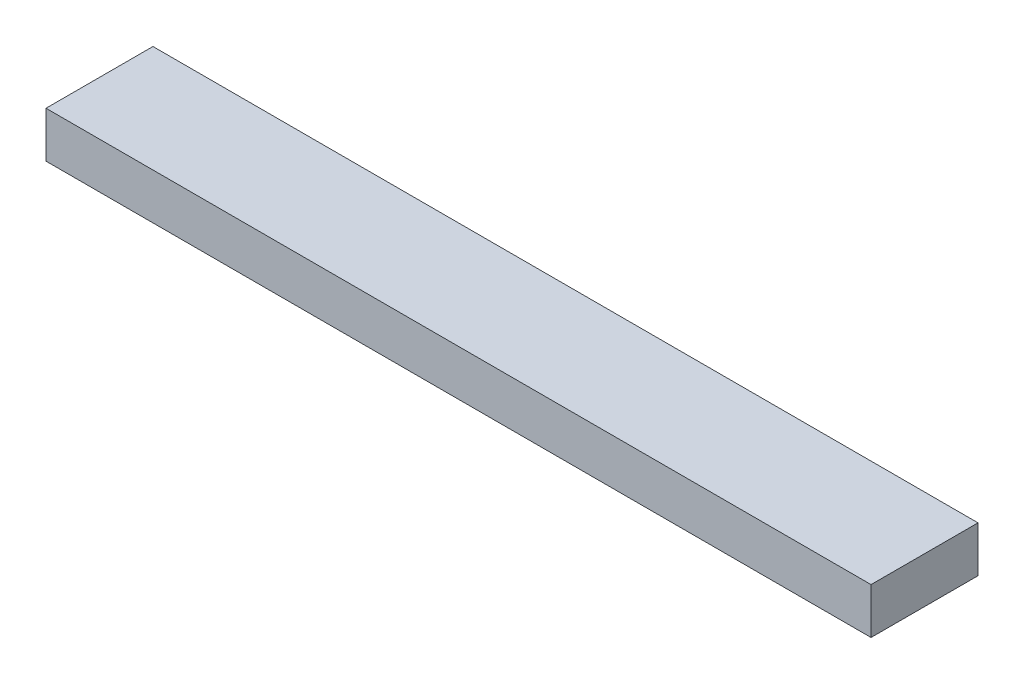
ISO-10303-21;
HEADER;
FILE_DESCRIPTION(('STEP AP214'),'2;1');
FILE_NAME('part.step','',(''),(''),'','','');
FILE_SCHEMA(('AUTOMOTIVE_DESIGN { 1 0 10303 214 1 1 1 1 }'));
ENDSEC;
DATA;
#1=APPLICATION_CONTEXT('core data for automotive mechanical design processes');
#2=APPLICATION_PROTOCOL_DEFINITION('international standard','automotive_design',2000,#1);
#3=PRODUCT_CONTEXT('',#1,'mechanical');
#4=PRODUCT('Part','Part','',(#3));
#5=PRODUCT_RELATED_PRODUCT_CATEGORY('part','',(#4));
#6=PRODUCT_DEFINITION_FORMATION('','',#4);
#7=PRODUCT_DEFINITION_CONTEXT('part definition',#1,'design');
#8=PRODUCT_DEFINITION('design','',#6,#7);
#9=PRODUCT_DEFINITION_SHAPE('','',#8);
#10=(LENGTH_UNIT() NAMED_UNIT(*) SI_UNIT(.MILLI.,.METRE.));
#11=(NAMED_UNIT(*) PLANE_ANGLE_UNIT() SI_UNIT($,.RADIAN.));
#12=(NAMED_UNIT(*) SI_UNIT($,.STERADIAN.) SOLID_ANGLE_UNIT());
#13=UNCERTAINTY_MEASURE_WITH_UNIT(LENGTH_MEASURE(1.E-05),#10,'distance_accuracy_value','');
#14=(GEOMETRIC_REPRESENTATION_CONTEXT(3) GLOBAL_UNCERTAINTY_ASSIGNED_CONTEXT((#13)) GLOBAL_UNIT_ASSIGNED_CONTEXT((#10,
#11,#12)) REPRESENTATION_CONTEXT('',''));
#15=CARTESIAN_POINT('',(0.,0.,0.));
#16=DIRECTION('',(0.,0.,1.));
#17=DIRECTION('',(1.,0.,0.));
#18=AXIS2_PLACEMENT_3D('',#15,#16,#17);
#19=CARTESIAN_POINT('',(0.,38.1,0.));
#20=DIRECTION('',(1.,0.,0.));
#21=DIRECTION('',(0.,0.,-1.));
#22=AXIS2_PLACEMENT_3D('',#19,#20,#21);
#23=PLANE('',#22);
#24=DIRECTION('',(0.,0.,1.));
#25=VECTOR('',#24,1.);
#26=CARTESIAN_POINT('',(0.,0.,0.));
#27=LINE('',#26,#25);
#28=CARTESIAN_POINT('',(0.,0.,-88.9));
#29=VERTEX_POINT('',#28);
#30=CARTESIAN_POINT('',(0.,0.,0.));
#31=VERTEX_POINT('',#30);
#32=EDGE_CURVE('E111',#29,#31,#27,.T.);
#33=ORIENTED_EDGE('',*,*,#32,.T.);
#34=DIRECTION('',(0.,-1.,0.));
#35=VECTOR('',#34,1.);
#36=CARTESIAN_POINT('',(0.,38.1,0.));
#37=LINE('',#36,#35);
#38=CARTESIAN_POINT('',(0.,38.1,0.));
#39=VERTEX_POINT('',#38);
#40=EDGE_CURVE('E11',#39,#31,#37,.T.);
#41=ORIENTED_EDGE('',*,*,#40,.F.);
#42=DIRECTION('',(0.,0.,1.));
#43=VECTOR('',#42,1.);
#44=CARTESIAN_POINT('',(0.,38.1,0.));
#45=LINE('',#44,#43);
#46=CARTESIAN_POINT('',(0.,38.1,-88.9));
#47=VERTEX_POINT('',#46);
#48=EDGE_CURVE('E94',#47,#39,#45,.T.);
#49=ORIENTED_EDGE('',*,*,#48,.F.);
#50=DIRECTION('',(0.,-1.,0.));
#51=VECTOR('',#50,1.);
#52=CARTESIAN_POINT('',(0.,38.1,-88.9));
#53=LINE('',#52,#51);
#54=EDGE_CURVE('E107',#47,#29,#53,.T.);
#55=ORIENTED_EDGE('',*,*,#54,.T.);
#56=EDGE_LOOP('',(#33,#41,#49,#55));
#57=FACE_BOUND('',#56,.T.);
#58=ADVANCED_FACE('F42',(#57),#23,.F.);
#59=CARTESIAN_POINT('',(0.,38.1,0.));
#60=DIRECTION('',(0.,0.,-1.));
#61=DIRECTION('',(-1.,0.,0.));
#62=AXIS2_PLACEMENT_3D('',#59,#60,#61);
#63=PLANE('',#62);
#64=DIRECTION('',(1.,0.,0.));
#65=VECTOR('',#64,1.);
#66=CARTESIAN_POINT('',(0.,0.,0.));
#67=LINE('',#66,#65);
#68=CARTESIAN_POINT('',(685.8,0.,0.));
#69=VERTEX_POINT('',#68);
#70=EDGE_CURVE('E99',#31,#69,#67,.T.);
#71=ORIENTED_EDGE('',*,*,#70,.T.);
#72=DIRECTION('',(0.,-1.,0.));
#73=VECTOR('',#72,1.);
#74=CARTESIAN_POINT('',(685.8,38.1,0.));
#75=LINE('',#74,#73);
#76=CARTESIAN_POINT('',(685.8,38.1,0.));
#77=VERTEX_POINT('',#76);
#78=EDGE_CURVE('E51',#77,#69,#75,.T.);
#79=ORIENTED_EDGE('',*,*,#78,.F.);
#80=DIRECTION('',(1.,0.,0.));
#81=VECTOR('',#80,1.);
#82=CARTESIAN_POINT('',(0.,38.1,0.));
#83=LINE('',#82,#81);
#84=EDGE_CURVE('E89',#39,#77,#83,.T.);
#85=ORIENTED_EDGE('',*,*,#84,.F.);
#86=ORIENTED_EDGE('',*,*,#40,.T.);
#87=EDGE_LOOP('',(#71,#79,#85,#86));
#88=FACE_BOUND('',#87,.T.);
#89=ADVANCED_FACE('F98',(#88),#63,.F.);
#90=CARTESIAN_POINT('',(685.8,38.1,0.));
#91=DIRECTION('',(-1.,0.,0.));
#92=DIRECTION('',(0.,0.,1.));
#93=AXIS2_PLACEMENT_3D('',#90,#91,#92);
#94=PLANE('',#93);
#95=DIRECTION('',(0.,0.,-1.));
#96=VECTOR('',#95,1.);
#97=CARTESIAN_POINT('',(685.8,0.,0.));
#98=LINE('',#97,#96);
#99=CARTESIAN_POINT('',(685.8,0.,-88.9));
#100=VERTEX_POINT('',#99);
#101=EDGE_CURVE('E76',#69,#100,#98,.T.);
#102=ORIENTED_EDGE('',*,*,#101,.T.);
#103=DIRECTION('',(0.,-1.,0.));
#104=VECTOR('',#103,1.);
#105=CARTESIAN_POINT('',(685.8,38.1,-88.9));
#106=LINE('',#105,#104);
#107=CARTESIAN_POINT('',(685.8,38.1,-88.9));
#108=VERTEX_POINT('',#107);
#109=EDGE_CURVE('E101',#108,#100,#106,.T.);
#110=ORIENTED_EDGE('',*,*,#109,.F.);
#111=DIRECTION('',(0.,0.,-1.));
#112=VECTOR('',#111,1.);
#113=CARTESIAN_POINT('',(685.8,38.1,0.));
#114=LINE('',#113,#112);
#115=EDGE_CURVE('E92',#77,#108,#114,.T.);
#116=ORIENTED_EDGE('',*,*,#115,.F.);
#117=ORIENTED_EDGE('',*,*,#78,.T.);
#118=EDGE_LOOP('',(#102,#110,#116,#117));
#119=FACE_BOUND('',#118,.T.);
#120=ADVANCED_FACE('F102',(#119),#94,.F.);
#121=CARTESIAN_POINT('',(0.,38.1,-88.9));
#122=DIRECTION('',(0.,0.,1.));
#123=DIRECTION('',(1.,0.,0.));
#124=AXIS2_PLACEMENT_3D('',#121,#122,#123);
#125=PLANE('',#124);
#126=DIRECTION('',(-1.,0.,0.));
#127=VECTOR('',#126,1.);
#128=CARTESIAN_POINT('',(0.,0.,-88.9));
#129=LINE('',#128,#127);
#130=EDGE_CURVE('E82',#100,#29,#129,.T.);
#131=ORIENTED_EDGE('',*,*,#130,.T.);
#132=ORIENTED_EDGE('',*,*,#54,.F.);
#133=DIRECTION('',(-1.,0.,0.));
#134=VECTOR('',#133,1.);
#135=CARTESIAN_POINT('',(0.,38.1,-88.9));
#136=LINE('',#135,#134);
#137=EDGE_CURVE('E59',#108,#47,#136,.T.);
#138=ORIENTED_EDGE('',*,*,#137,.F.);
#139=ORIENTED_EDGE('',*,*,#109,.T.);
#140=EDGE_LOOP('',(#131,#132,#138,#139));
#141=FACE_BOUND('',#140,.T.);
#142=ADVANCED_FACE('F125',(#141),#125,.F.);
#143=CARTESIAN_POINT('',(0.,38.1,0.));
#144=DIRECTION('',(0.,-1.,0.));
#145=DIRECTION('',(0.,0.,-1.));
#146=AXIS2_PLACEMENT_3D('',#143,#144,#145);
#147=PLANE('',#146);
#148=ORIENTED_EDGE('',*,*,#48,.T.);
#149=ORIENTED_EDGE('',*,*,#84,.T.);
#150=ORIENTED_EDGE('',*,*,#115,.T.);
#151=ORIENTED_EDGE('',*,*,#137,.T.);
#152=EDGE_LOOP('',(#148,#149,#150,#151));
#153=FACE_BOUND('',#152,.T.);
#154=ADVANCED_FACE('F90',(#153),#147,.F.);
#155=CARTESIAN_POINT('',(0.,0.,0.));
#156=DIRECTION('',(0.,-1.,0.));
#157=DIRECTION('',(0.,0.,-1.));
#158=AXIS2_PLACEMENT_3D('',#155,#156,#157);
#159=PLANE('',#158);
#160=ORIENTED_EDGE('',*,*,#32,.F.);
#161=ORIENTED_EDGE('',*,*,#130,.F.);
#162=ORIENTED_EDGE('',*,*,#101,.F.);
#163=ORIENTED_EDGE('',*,*,#70,.F.);
#164=EDGE_LOOP('',(#160,#161,#162,#163));
#165=FACE_BOUND('',#164,.T.);
#166=ADVANCED_FACE('F128',(#165),#159,.T.);
#167=CLOSED_SHELL('',(#58,#89,#120,#142,#154,#166));
#168=MANIFOLD_SOLID_BREP('B2',#167);
#169=ADVANCED_BREP_SHAPE_REPRESENTATION('',(#18,#168),#14);
#170=SHAPE_DEFINITION_REPRESENTATION(#9,#169);
ENDSEC;
END-ISO-10303-21;
